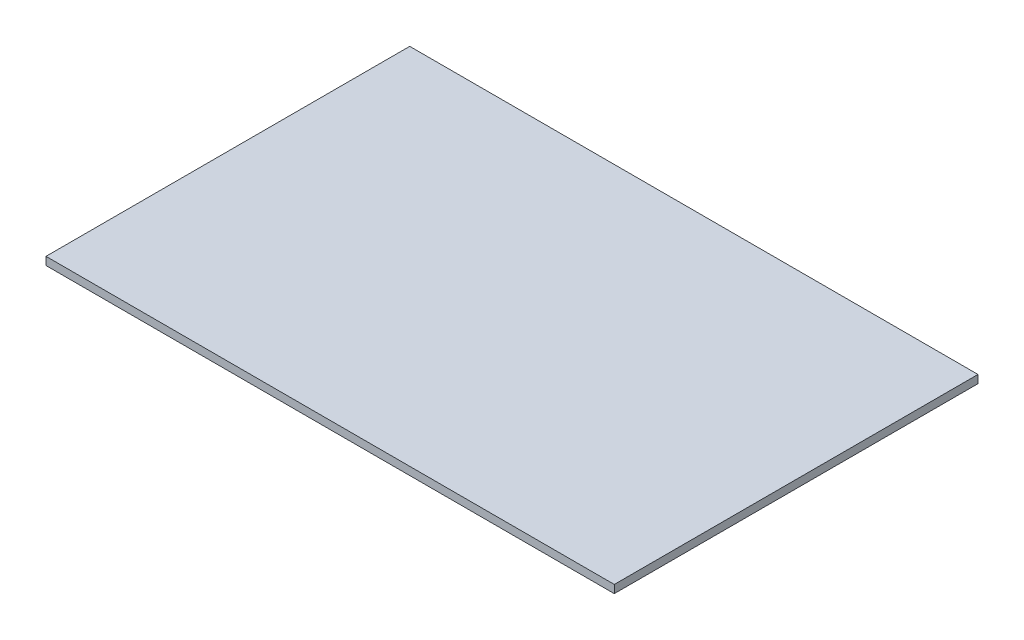
ISO-10303-21;
HEADER;
FILE_DESCRIPTION(('STEP AP214'),'2;1');
FILE_NAME('part.step','',(''),(''),'','','');
FILE_SCHEMA(('AUTOMOTIVE_DESIGN { 1 0 10303 214 1 1 1 1 }'));
ENDSEC;
DATA;
#1=APPLICATION_CONTEXT('core data for automotive mechanical design processes');
#2=APPLICATION_PROTOCOL_DEFINITION('international standard','automotive_design',2000,#1);
#3=PRODUCT_CONTEXT('',#1,'mechanical');
#4=PRODUCT('Part','Part','',(#3));
#5=PRODUCT_RELATED_PRODUCT_CATEGORY('part','',(#4));
#6=PRODUCT_DEFINITION_FORMATION('','',#4);
#7=PRODUCT_DEFINITION_CONTEXT('part definition',#1,'design');
#8=PRODUCT_DEFINITION('design','',#6,#7);
#9=PRODUCT_DEFINITION_SHAPE('','',#8);
#10=(LENGTH_UNIT() NAMED_UNIT(*) SI_UNIT(.MILLI.,.METRE.));
#11=(NAMED_UNIT(*) PLANE_ANGLE_UNIT() SI_UNIT($,.RADIAN.));
#12=(NAMED_UNIT(*) SI_UNIT($,.STERADIAN.) SOLID_ANGLE_UNIT());
#13=UNCERTAINTY_MEASURE_WITH_UNIT(LENGTH_MEASURE(1.E-05),#10,'distance_accuracy_value','');
#14=(GEOMETRIC_REPRESENTATION_CONTEXT(3) GLOBAL_UNCERTAINTY_ASSIGNED_CONTEXT((#13)) GLOBAL_UNIT_ASSIGNED_CONTEXT((#10,
#11,#12)) REPRESENTATION_CONTEXT('',''));
#15=CARTESIAN_POINT('',(0.,0.,0.));
#16=DIRECTION('',(0.,0.,1.));
#17=DIRECTION('',(1.,0.,0.));
#18=AXIS2_PLACEMENT_3D('',#15,#16,#17);
#19=CARTESIAN_POINT('',(635.,17.8816,406.4));
#20=DIRECTION('',(-1.,0.,0.));
#21=DIRECTION('',(0.,0.,1.));
#22=AXIS2_PLACEMENT_3D('',#19,#20,#21);
#23=PLANE('',#22);
#24=DIRECTION('',(0.,0.,-1.));
#25=VECTOR('',#24,1.);
#26=CARTESIAN_POINT('',(635.,0.,406.4));
#27=LINE('',#26,#25);
#28=CARTESIAN_POINT('',(635.,0.,406.4));
#29=VERTEX_POINT('',#28);
#30=CARTESIAN_POINT('',(635.,0.,-406.4));
#31=VERTEX_POINT('',#30);
#32=EDGE_CURVE('E111',#29,#31,#27,.T.);
#33=ORIENTED_EDGE('',*,*,#32,.T.);
#34=DIRECTION('',(0.,-1.,0.));
#35=VECTOR('',#34,1.);
#36=CARTESIAN_POINT('',(635.,17.8816,-406.4));
#37=LINE('',#36,#35);
#38=CARTESIAN_POINT('',(635.,17.8816,-406.4));
#39=VERTEX_POINT('',#38);
#40=EDGE_CURVE('E11',#39,#31,#37,.T.);
#41=ORIENTED_EDGE('',*,*,#40,.F.);
#42=DIRECTION('',(0.,0.,-1.));
#43=VECTOR('',#42,1.);
#44=CARTESIAN_POINT('',(635.,17.8816,406.4));
#45=LINE('',#44,#43);
#46=CARTESIAN_POINT('',(635.,17.8816,406.4));
#47=VERTEX_POINT('',#46);
#48=EDGE_CURVE('E95',#47,#39,#45,.T.);
#49=ORIENTED_EDGE('',*,*,#48,.F.);
#50=DIRECTION('',(0.,-1.,0.));
#51=VECTOR('',#50,1.);
#52=CARTESIAN_POINT('',(635.,17.8816,406.4));
#53=LINE('',#52,#51);
#54=EDGE_CURVE('E107',#47,#29,#53,.T.);
#55=ORIENTED_EDGE('',*,*,#54,.T.);
#56=EDGE_LOOP('',(#33,#41,#49,#55));
#57=FACE_BOUND('',#56,.T.);
#58=ADVANCED_FACE('F43',(#57),#23,.F.);
#59=CARTESIAN_POINT('',(-635.,17.8816,-406.4));
#60=DIRECTION('',(0.,0.,1.));
#61=DIRECTION('',(1.,0.,0.));
#62=AXIS2_PLACEMENT_3D('',#59,#60,#61);
#63=PLANE('',#62);
#64=DIRECTION('',(-1.,0.,0.));
#65=VECTOR('',#64,1.);
#66=CARTESIAN_POINT('',(-635.,0.,-406.4));
#67=LINE('',#66,#65);
#68=CARTESIAN_POINT('',(-635.,0.,-406.4));
#69=VERTEX_POINT('',#68);
#70=EDGE_CURVE('E100',#31,#69,#67,.T.);
#71=ORIENTED_EDGE('',*,*,#70,.T.);
#72=DIRECTION('',(0.,-1.,0.));
#73=VECTOR('',#72,1.);
#74=CARTESIAN_POINT('',(-635.,17.8816,-406.4));
#75=LINE('',#74,#73);
#76=CARTESIAN_POINT('',(-635.,17.8816,-406.4));
#77=VERTEX_POINT('',#76);
#78=EDGE_CURVE('E52',#77,#69,#75,.T.);
#79=ORIENTED_EDGE('',*,*,#78,.F.);
#80=DIRECTION('',(-1.,0.,0.));
#81=VECTOR('',#80,1.);
#82=CARTESIAN_POINT('',(-635.,17.8816,-406.4));
#83=LINE('',#82,#81);
#84=EDGE_CURVE('E90',#39,#77,#83,.T.);
#85=ORIENTED_EDGE('',*,*,#84,.F.);
#86=ORIENTED_EDGE('',*,*,#40,.T.);
#87=EDGE_LOOP('',(#71,#79,#85,#86));
#88=FACE_BOUND('',#87,.T.);
#89=ADVANCED_FACE('F99',(#88),#63,.F.);
#90=CARTESIAN_POINT('',(-635.,17.8816,406.4));
#91=DIRECTION('',(1.,0.,0.));
#92=DIRECTION('',(0.,0.,-1.));
#93=AXIS2_PLACEMENT_3D('',#90,#91,#92);
#94=PLANE('',#93);
#95=DIRECTION('',(0.,0.,1.));
#96=VECTOR('',#95,1.);
#97=CARTESIAN_POINT('',(-635.,0.,406.4));
#98=LINE('',#97,#96);
#99=CARTESIAN_POINT('',(-635.,0.,406.4));
#100=VERTEX_POINT('',#99);
#101=EDGE_CURVE('E77',#69,#100,#98,.T.);
#102=ORIENTED_EDGE('',*,*,#101,.T.);
#103=DIRECTION('',(0.,-1.,0.));
#104=VECTOR('',#103,1.);
#105=CARTESIAN_POINT('',(-635.,17.8816,406.4));
#106=LINE('',#105,#104);
#107=CARTESIAN_POINT('',(-635.,17.8816,406.4));
#108=VERTEX_POINT('',#107);
#109=EDGE_CURVE('E102',#108,#100,#106,.T.);
#110=ORIENTED_EDGE('',*,*,#109,.F.);
#111=DIRECTION('',(0.,0.,1.));
#112=VECTOR('',#111,1.);
#113=CARTESIAN_POINT('',(-635.,17.8816,406.4));
#114=LINE('',#113,#112);
#115=EDGE_CURVE('E93',#77,#108,#114,.T.);
#116=ORIENTED_EDGE('',*,*,#115,.F.);
#117=ORIENTED_EDGE('',*,*,#78,.T.);
#118=EDGE_LOOP('',(#102,#110,#116,#117));
#119=FACE_BOUND('',#118,.T.);
#120=ADVANCED_FACE('F103',(#119),#94,.F.);
#121=CARTESIAN_POINT('',(-635.,17.8816,406.4));
#122=DIRECTION('',(0.,0.,-1.));
#123=DIRECTION('',(-1.,0.,0.));
#124=AXIS2_PLACEMENT_3D('',#121,#122,#123);
#125=PLANE('',#124);
#126=DIRECTION('',(1.,0.,0.));
#127=VECTOR('',#126,1.);
#128=CARTESIAN_POINT('',(-635.,0.,406.4));
#129=LINE('',#128,#127);
#130=EDGE_CURVE('E83',#100,#29,#129,.T.);
#131=ORIENTED_EDGE('',*,*,#130,.T.);
#132=ORIENTED_EDGE('',*,*,#54,.F.);
#133=DIRECTION('',(1.,0.,0.));
#134=VECTOR('',#133,1.);
#135=CARTESIAN_POINT('',(-635.,17.8816,406.4));
#136=LINE('',#135,#134);
#137=EDGE_CURVE('E60',#108,#47,#136,.T.);
#138=ORIENTED_EDGE('',*,*,#137,.F.);
#139=ORIENTED_EDGE('',*,*,#109,.T.);
#140=EDGE_LOOP('',(#131,#132,#138,#139));
#141=FACE_BOUND('',#140,.T.);
#142=ADVANCED_FACE('F124',(#141),#125,.F.);
#143=CARTESIAN_POINT('',(0.,17.8816,0.));
#144=DIRECTION('',(0.,-1.,0.));
#145=DIRECTION('',(0.,0.,-1.));
#146=AXIS2_PLACEMENT_3D('',#143,#144,#145);
#147=PLANE('',#146);
#148=ORIENTED_EDGE('',*,*,#48,.T.);
#149=ORIENTED_EDGE('',*,*,#84,.T.);
#150=ORIENTED_EDGE('',*,*,#115,.T.);
#151=ORIENTED_EDGE('',*,*,#137,.T.);
#152=EDGE_LOOP('',(#148,#149,#150,#151));
#153=FACE_BOUND('',#152,.T.);
#154=ADVANCED_FACE('F91',(#153),#147,.F.);
#155=CARTESIAN_POINT('',(0.,0.,0.));
#156=DIRECTION('',(0.,-1.,0.));
#157=DIRECTION('',(0.,0.,-1.));
#158=AXIS2_PLACEMENT_3D('',#155,#156,#157);
#159=PLANE('',#158);
#160=ORIENTED_EDGE('',*,*,#32,.F.);
#161=ORIENTED_EDGE('',*,*,#130,.F.);
#162=ORIENTED_EDGE('',*,*,#101,.F.);
#163=ORIENTED_EDGE('',*,*,#70,.F.);
#164=EDGE_LOOP('',(#160,#161,#162,#163));
#165=FACE_BOUND('',#164,.T.);
#166=ADVANCED_FACE('F127',(#165),#159,.T.);
#167=CLOSED_SHELL('',(#58,#89,#120,#142,#154,#166));
#168=MANIFOLD_SOLID_BREP('B2',#167);
#169=ADVANCED_BREP_SHAPE_REPRESENTATION('',(#18,#168),#14);
#170=SHAPE_DEFINITION_REPRESENTATION(#9,#169);
ENDSEC;
END-ISO-10303-21;
